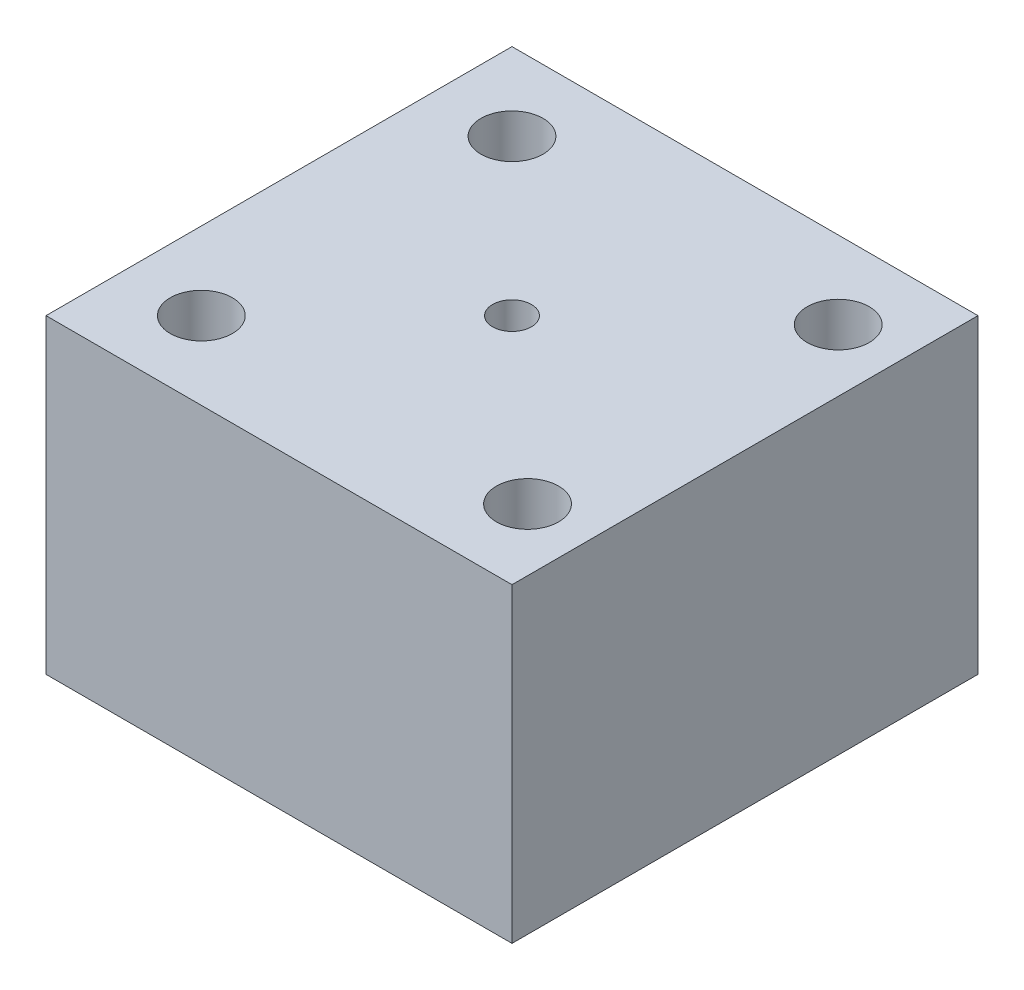
ISO-10303-21;
HEADER;
FILE_DESCRIPTION(('STEP AP214'),'2;1');
FILE_NAME('part.step','',(''),(''),'','','');
FILE_SCHEMA(('AUTOMOTIVE_DESIGN { 1 0 10303 214 1 1 1 1 }'));
ENDSEC;
DATA;
#1=APPLICATION_CONTEXT('core data for automotive mechanical design processes');
#2=APPLICATION_PROTOCOL_DEFINITION('international standard','automotive_design',2000,#1);
#3=PRODUCT_CONTEXT('',#1,'mechanical');
#4=PRODUCT('Part','Part','',(#3));
#5=PRODUCT_RELATED_PRODUCT_CATEGORY('part','',(#4));
#6=PRODUCT_DEFINITION_FORMATION('','',#4);
#7=PRODUCT_DEFINITION_CONTEXT('part definition',#1,'design');
#8=PRODUCT_DEFINITION('design','',#6,#7);
#9=PRODUCT_DEFINITION_SHAPE('','',#8);
#10=(LENGTH_UNIT() NAMED_UNIT(*) SI_UNIT(.MILLI.,.METRE.));
#11=(NAMED_UNIT(*) PLANE_ANGLE_UNIT() SI_UNIT($,.RADIAN.));
#12=(NAMED_UNIT(*) SI_UNIT($,.STERADIAN.) SOLID_ANGLE_UNIT());
#13=UNCERTAINTY_MEASURE_WITH_UNIT(LENGTH_MEASURE(1.E-05),#10,'distance_accuracy_value','');
#14=(GEOMETRIC_REPRESENTATION_CONTEXT(3) GLOBAL_UNCERTAINTY_ASSIGNED_CONTEXT((#13)) GLOBAL_UNIT_ASSIGNED_CONTEXT((#10,
#11,#12)) REPRESENTATION_CONTEXT('',''));
#15=CARTESIAN_POINT('',(0.,0.,0.));
#16=DIRECTION('',(0.,0.,1.));
#17=DIRECTION('',(1.,0.,0.));
#18=AXIS2_PLACEMENT_3D('',#15,#16,#17);
#19=CARTESIAN_POINT('',(0.,20.,0.));
#20=DIRECTION('',(1.,0.,0.));
#21=DIRECTION('',(0.,0.,-1.));
#22=AXIS2_PLACEMENT_3D('',#19,#20,#21);
#23=PLANE('',#22);
#24=DIRECTION('',(0.,0.,1.));
#25=VECTOR('',#24,1.);
#26=CARTESIAN_POINT('',(0.,0.,0.));
#27=LINE('',#26,#25);
#28=CARTESIAN_POINT('',(0.,0.,-30.));
#29=VERTEX_POINT('',#28);
#30=CARTESIAN_POINT('',(0.,0.,0.));
#31=VERTEX_POINT('',#30);
#32=EDGE_CURVE('E107',#29,#31,#27,.T.);
#33=ORIENTED_EDGE('',*,*,#32,.T.);
#34=DIRECTION('',(0.,-1.,0.));
#35=VECTOR('',#34,1.);
#36=CARTESIAN_POINT('',(0.,20.,0.));
#37=LINE('',#36,#35);
#38=CARTESIAN_POINT('',(0.,20.,0.));
#39=VERTEX_POINT('',#38);
#40=EDGE_CURVE('E11',#39,#31,#37,.T.);
#41=ORIENTED_EDGE('',*,*,#40,.F.);
#42=DIRECTION('',(0.,0.,1.));
#43=VECTOR('',#42,1.);
#44=CARTESIAN_POINT('',(0.,20.,0.));
#45=LINE('',#44,#43);
#46=CARTESIAN_POINT('',(0.,20.,-30.));
#47=VERTEX_POINT('',#46);
#48=EDGE_CURVE('E91',#47,#39,#45,.T.);
#49=ORIENTED_EDGE('',*,*,#48,.F.);
#50=DIRECTION('',(0.,-1.,0.));
#51=VECTOR('',#50,1.);
#52=CARTESIAN_POINT('',(0.,20.,-30.));
#53=LINE('',#52,#51);
#54=EDGE_CURVE('E103',#47,#29,#53,.T.);
#55=ORIENTED_EDGE('',*,*,#54,.T.);
#56=EDGE_LOOP('',(#33,#41,#49,#55));
#57=FACE_BOUND('',#56,.T.);
#58=ADVANCED_FACE('F39',(#57),#23,.F.);
#59=CARTESIAN_POINT('',(0.,20.,0.));
#60=DIRECTION('',(0.,0.,-1.));
#61=DIRECTION('',(-1.,0.,0.));
#62=AXIS2_PLACEMENT_3D('',#59,#60,#61);
#63=PLANE('',#62);
#64=DIRECTION('',(1.,0.,0.));
#65=VECTOR('',#64,1.);
#66=CARTESIAN_POINT('',(0.,0.,0.));
#67=LINE('',#66,#65);
#68=CARTESIAN_POINT('',(30.,0.,0.));
#69=VERTEX_POINT('',#68);
#70=EDGE_CURVE('E96',#31,#69,#67,.T.);
#71=ORIENTED_EDGE('',*,*,#70,.T.);
#72=DIRECTION('',(0.,-1.,0.));
#73=VECTOR('',#72,1.);
#74=CARTESIAN_POINT('',(30.,20.,0.));
#75=LINE('',#74,#73);
#76=CARTESIAN_POINT('',(30.,20.,0.));
#77=VERTEX_POINT('',#76);
#78=EDGE_CURVE('E48',#77,#69,#75,.T.);
#79=ORIENTED_EDGE('',*,*,#78,.F.);
#80=DIRECTION('',(1.,0.,0.));
#81=VECTOR('',#80,1.);
#82=CARTESIAN_POINT('',(0.,20.,0.));
#83=LINE('',#82,#81);
#84=EDGE_CURVE('E86',#39,#77,#83,.T.);
#85=ORIENTED_EDGE('',*,*,#84,.F.);
#86=ORIENTED_EDGE('',*,*,#40,.T.);
#87=EDGE_LOOP('',(#71,#79,#85,#86));
#88=FACE_BOUND('',#87,.T.);
#89=ADVANCED_FACE('F95',(#88),#63,.F.);
#90=CARTESIAN_POINT('',(30.,20.,0.));
#91=DIRECTION('',(-1.,0.,0.));
#92=DIRECTION('',(0.,0.,1.));
#93=AXIS2_PLACEMENT_3D('',#90,#91,#92);
#94=PLANE('',#93);
#95=DIRECTION('',(0.,0.,-1.));
#96=VECTOR('',#95,1.);
#97=CARTESIAN_POINT('',(30.,0.,0.));
#98=LINE('',#97,#96);
#99=CARTESIAN_POINT('',(30.,0.,-30.));
#100=VERTEX_POINT('',#99);
#101=EDGE_CURVE('E73',#69,#100,#98,.T.);
#102=ORIENTED_EDGE('',*,*,#101,.T.);
#103=DIRECTION('',(0.,-1.,0.));
#104=VECTOR('',#103,1.);
#105=CARTESIAN_POINT('',(30.,20.,-30.));
#106=LINE('',#105,#104);
#107=CARTESIAN_POINT('',(30.,20.,-30.));
#108=VERTEX_POINT('',#107);
#109=EDGE_CURVE('E98',#108,#100,#106,.T.);
#110=ORIENTED_EDGE('',*,*,#109,.F.);
#111=DIRECTION('',(0.,0.,-1.));
#112=VECTOR('',#111,1.);
#113=CARTESIAN_POINT('',(30.,20.,0.));
#114=LINE('',#113,#112);
#115=EDGE_CURVE('E89',#77,#108,#114,.T.);
#116=ORIENTED_EDGE('',*,*,#115,.F.);
#117=ORIENTED_EDGE('',*,*,#78,.T.);
#118=EDGE_LOOP('',(#102,#110,#116,#117));
#119=FACE_BOUND('',#118,.T.);
#120=ADVANCED_FACE('F99',(#119),#94,.F.);
#121=CARTESIAN_POINT('',(0.,20.,-30.));
#122=DIRECTION('',(0.,0.,1.));
#123=DIRECTION('',(1.,0.,0.));
#124=AXIS2_PLACEMENT_3D('',#121,#122,#123);
#125=PLANE('',#124);
#126=DIRECTION('',(-1.,0.,0.));
#127=VECTOR('',#126,1.);
#128=CARTESIAN_POINT('',(0.,0.,-30.));
#129=LINE('',#128,#127);
#130=EDGE_CURVE('E79',#100,#29,#129,.T.);
#131=ORIENTED_EDGE('',*,*,#130,.T.);
#132=ORIENTED_EDGE('',*,*,#54,.F.);
#133=DIRECTION('',(-1.,0.,0.));
#134=VECTOR('',#133,1.);
#135=CARTESIAN_POINT('',(0.,20.,-30.));
#136=LINE('',#135,#134);
#137=EDGE_CURVE('E56',#108,#47,#136,.T.);
#138=ORIENTED_EDGE('',*,*,#137,.F.);
#139=ORIENTED_EDGE('',*,*,#109,.T.);
#140=EDGE_LOOP('',(#131,#132,#138,#139));
#141=FACE_BOUND('',#140,.T.);
#142=ADVANCED_FACE('F121',(#141),#125,.F.);
#143=CARTESIAN_POINT('',(0.,20.,0.));
#144=DIRECTION('',(0.,-1.,0.));
#145=DIRECTION('',(0.,0.,-1.));
#146=AXIS2_PLACEMENT_3D('',#143,#144,#145);
#147=PLANE('',#146);
#148=CARTESIAN_POINT('',(15.,20.,-15.));
#149=DIRECTION('',(0.,1.,0.));
#150=DIRECTION('',(0.,0.,1.));
#151=AXIS2_PLACEMENT_3D('',#148,#149,#150);
#152=CIRCLE('',#151,1.25);
#153=CARTESIAN_POINT('',(15.,20.,-13.75));
#154=VERTEX_POINT('',#153);
#155=EDGE_CURVE('E136',#154,#154,#152,.T.);
#156=ORIENTED_EDGE('',*,*,#155,.F.);
#157=EDGE_LOOP('',(#156));
#158=FACE_BOUND('',#157,.T.);
#159=CARTESIAN_POINT('',(26.,20.,-25.));
#160=DIRECTION('',(0.,1.,0.));
#161=DIRECTION('',(0.,0.,1.));
#162=AXIS2_PLACEMENT_3D('',#159,#160,#161);
#163=CIRCLE('',#162,2.);
#164=CARTESIAN_POINT('',(26.,20.,-23.));
#165=VERTEX_POINT('',#164);
#166=EDGE_CURVE('E144',#165,#165,#163,.T.);
#167=ORIENTED_EDGE('',*,*,#166,.F.);
#168=EDGE_LOOP('',(#167));
#169=FACE_BOUND('',#168,.T.);
#170=CARTESIAN_POINT('',(26.,20.,-5.));
#171=DIRECTION('',(0.,1.,0.));
#172=DIRECTION('',(0.,0.,1.));
#173=AXIS2_PLACEMENT_3D('',#170,#171,#172);
#174=CIRCLE('',#173,2.);
#175=CARTESIAN_POINT('',(26.,20.,-3.));
#176=VERTEX_POINT('',#175);
#177=EDGE_CURVE('E152',#176,#176,#174,.T.);
#178=ORIENTED_EDGE('',*,*,#177,.F.);
#179=EDGE_LOOP('',(#178));
#180=FACE_BOUND('',#179,.T.);
#181=CARTESIAN_POINT('',(5.,20.,-5.));
#182=DIRECTION('',(0.,1.,0.));
#183=DIRECTION('',(0.,0.,1.));
#184=AXIS2_PLACEMENT_3D('',#181,#182,#183);
#185=CIRCLE('',#184,2.);
#186=CARTESIAN_POINT('',(5.,20.,-3.));
#187=VERTEX_POINT('',#186);
#188=EDGE_CURVE('E160',#187,#187,#185,.T.);
#189=ORIENTED_EDGE('',*,*,#188,.F.);
#190=EDGE_LOOP('',(#189));
#191=FACE_BOUND('',#190,.T.);
#192=CARTESIAN_POINT('',(5.,20.,-25.));
#193=DIRECTION('',(0.,1.,0.));
#194=DIRECTION('',(0.,0.,1.));
#195=AXIS2_PLACEMENT_3D('',#192,#193,#194);
#196=CIRCLE('',#195,2.);
#197=CARTESIAN_POINT('',(5.,20.,-23.));
#198=VERTEX_POINT('',#197);
#199=EDGE_CURVE('E128',#198,#198,#196,.T.);
#200=ORIENTED_EDGE('',*,*,#199,.F.);
#201=EDGE_LOOP('',(#200));
#202=FACE_BOUND('',#201,.T.);
#203=ORIENTED_EDGE('',*,*,#48,.T.);
#204=ORIENTED_EDGE('',*,*,#84,.T.);
#205=ORIENTED_EDGE('',*,*,#115,.T.);
#206=ORIENTED_EDGE('',*,*,#137,.T.);
#207=EDGE_LOOP('',(#203,#204,#205,#206));
#208=FACE_BOUND('',#207,.T.);
#209=ADVANCED_FACE('F87',(#158,#169,#180,#191,#202,#208),#147,.F.);
#210=CARTESIAN_POINT('',(0.,0.,0.));
#211=DIRECTION('',(0.,-1.,0.));
#212=DIRECTION('',(0.,0.,-1.));
#213=AXIS2_PLACEMENT_3D('',#210,#211,#212);
#214=PLANE('',#213);
#215=CARTESIAN_POINT('',(15.,0.,-15.));
#216=DIRECTION('',(0.,1.,0.));
#217=DIRECTION('',(0.,0.,1.));
#218=AXIS2_PLACEMENT_3D('',#215,#216,#217);
#219=CIRCLE('',#218,1.25);
#220=CARTESIAN_POINT('',(15.,0.,-13.75));
#221=VERTEX_POINT('',#220);
#222=EDGE_CURVE('E140',#221,#221,#219,.T.);
#223=ORIENTED_EDGE('',*,*,#222,.T.);
#224=EDGE_LOOP('',(#223));
#225=FACE_BOUND('',#224,.T.);
#226=CARTESIAN_POINT('',(26.,0.,-25.));
#227=DIRECTION('',(0.,1.,0.));
#228=DIRECTION('',(0.,0.,1.));
#229=AXIS2_PLACEMENT_3D('',#226,#227,#228);
#230=CIRCLE('',#229,2.);
#231=CARTESIAN_POINT('',(26.,0.,-23.));
#232=VERTEX_POINT('',#231);
#233=EDGE_CURVE('E148',#232,#232,#230,.T.);
#234=ORIENTED_EDGE('',*,*,#233,.T.);
#235=EDGE_LOOP('',(#234));
#236=FACE_BOUND('',#235,.T.);
#237=CARTESIAN_POINT('',(26.,0.,-5.));
#238=DIRECTION('',(0.,1.,0.));
#239=DIRECTION('',(0.,0.,1.));
#240=AXIS2_PLACEMENT_3D('',#237,#238,#239);
#241=CIRCLE('',#240,2.);
#242=CARTESIAN_POINT('',(26.,0.,-3.));
#243=VERTEX_POINT('',#242);
#244=EDGE_CURVE('E156',#243,#243,#241,.T.);
#245=ORIENTED_EDGE('',*,*,#244,.T.);
#246=EDGE_LOOP('',(#245));
#247=FACE_BOUND('',#246,.T.);
#248=CARTESIAN_POINT('',(5.,0.,-5.));
#249=DIRECTION('',(0.,1.,0.));
#250=DIRECTION('',(0.,0.,1.));
#251=AXIS2_PLACEMENT_3D('',#248,#249,#250);
#252=CIRCLE('',#251,2.);
#253=CARTESIAN_POINT('',(5.,0.,-3.));
#254=VERTEX_POINT('',#253);
#255=EDGE_CURVE('E132',#254,#254,#252,.T.);
#256=ORIENTED_EDGE('',*,*,#255,.T.);
#257=EDGE_LOOP('',(#256));
#258=FACE_BOUND('',#257,.T.);
#259=CARTESIAN_POINT('',(5.,0.,-25.));
#260=DIRECTION('',(0.,1.,0.));
#261=DIRECTION('',(0.,0.,1.));
#262=AXIS2_PLACEMENT_3D('',#259,#260,#261);
#263=CIRCLE('',#262,2.);
#264=CARTESIAN_POINT('',(5.,0.,-23.));
#265=VERTEX_POINT('',#264);
#266=EDGE_CURVE('E111',#265,#265,#263,.T.);
#267=ORIENTED_EDGE('',*,*,#266,.T.);
#268=EDGE_LOOP('',(#267));
#269=FACE_BOUND('',#268,.T.);
#270=ORIENTED_EDGE('',*,*,#32,.F.);
#271=ORIENTED_EDGE('',*,*,#130,.F.);
#272=ORIENTED_EDGE('',*,*,#101,.F.);
#273=ORIENTED_EDGE('',*,*,#70,.F.);
#274=EDGE_LOOP('',(#270,#271,#272,#273));
#275=FACE_BOUND('',#274,.T.);
#276=ADVANCED_FACE('F124',(#225,#236,#247,#258,#269,#275),#214,.T.);
#277=CARTESIAN_POINT('',(5.,0.,-25.));
#278=DIRECTION('',(0.,1.,0.));
#279=DIRECTION('',(0.,0.,1.));
#280=AXIS2_PLACEMENT_3D('',#277,#278,#279);
#281=CYLINDRICAL_SURFACE('',#280,2.);
#282=ORIENTED_EDGE('',*,*,#266,.F.);
#283=EDGE_LOOP('',(#282));
#284=FACE_BOUND('',#283,.T.);
#285=ORIENTED_EDGE('',*,*,#199,.T.);
#286=EDGE_LOOP('',(#285));
#287=FACE_BOUND('',#286,.T.);
#288=ADVANCED_FACE('F174',(#284,#287),#281,.F.);
#289=CARTESIAN_POINT('',(5.,0.,-5.));
#290=DIRECTION('',(0.,1.,0.));
#291=DIRECTION('',(0.,0.,1.));
#292=AXIS2_PLACEMENT_3D('',#289,#290,#291);
#293=CYLINDRICAL_SURFACE('',#292,2.);
#294=ORIENTED_EDGE('',*,*,#255,.F.);
#295=EDGE_LOOP('',(#294));
#296=FACE_BOUND('',#295,.T.);
#297=ORIENTED_EDGE('',*,*,#188,.T.);
#298=EDGE_LOOP('',(#297));
#299=FACE_BOUND('',#298,.T.);
#300=ADVANCED_FACE('F170',(#296,#299),#293,.F.);
#301=CARTESIAN_POINT('',(26.,0.,-5.));
#302=DIRECTION('',(0.,1.,0.));
#303=DIRECTION('',(0.,0.,1.));
#304=AXIS2_PLACEMENT_3D('',#301,#302,#303);
#305=CYLINDRICAL_SURFACE('',#304,2.);
#306=ORIENTED_EDGE('',*,*,#244,.F.);
#307=EDGE_LOOP('',(#306));
#308=FACE_BOUND('',#307,.T.);
#309=ORIENTED_EDGE('',*,*,#177,.T.);
#310=EDGE_LOOP('',(#309));
#311=FACE_BOUND('',#310,.T.);
#312=ADVANCED_FACE('F173',(#308,#311),#305,.F.);
#313=CARTESIAN_POINT('',(26.,0.,-25.));
#314=DIRECTION('',(0.,1.,0.));
#315=DIRECTION('',(0.,0.,1.));
#316=AXIS2_PLACEMENT_3D('',#313,#314,#315);
#317=CYLINDRICAL_SURFACE('',#316,2.);
#318=ORIENTED_EDGE('',*,*,#233,.F.);
#319=EDGE_LOOP('',(#318));
#320=FACE_BOUND('',#319,.T.);
#321=ORIENTED_EDGE('',*,*,#166,.T.);
#322=EDGE_LOOP('',(#321));
#323=FACE_BOUND('',#322,.T.);
#324=ADVANCED_FACE('F235',(#320,#323),#317,.F.);
#325=CARTESIAN_POINT('',(15.,0.,-15.));
#326=DIRECTION('',(0.,1.,0.));
#327=DIRECTION('',(0.,0.,1.));
#328=AXIS2_PLACEMENT_3D('',#325,#326,#327);
#329=CYLINDRICAL_SURFACE('',#328,1.25);
#330=ORIENTED_EDGE('',*,*,#222,.F.);
#331=EDGE_LOOP('',(#330));
#332=FACE_BOUND('',#331,.T.);
#333=ORIENTED_EDGE('',*,*,#155,.T.);
#334=EDGE_LOOP('',(#333));
#335=FACE_BOUND('',#334,.T.);
#336=ADVANCED_FACE('F245',(#332,#335),#329,.F.);
#337=CLOSED_SHELL('',(#58,#89,#120,#142,#209,#276,#288,#300,#312,#324,#336));
#338=MANIFOLD_SOLID_BREP('B2',#337);
#339=ADVANCED_BREP_SHAPE_REPRESENTATION('',(#18,#338),#14);
#340=SHAPE_DEFINITION_REPRESENTATION(#9,#339);
ENDSEC;
END-ISO-10303-21;
